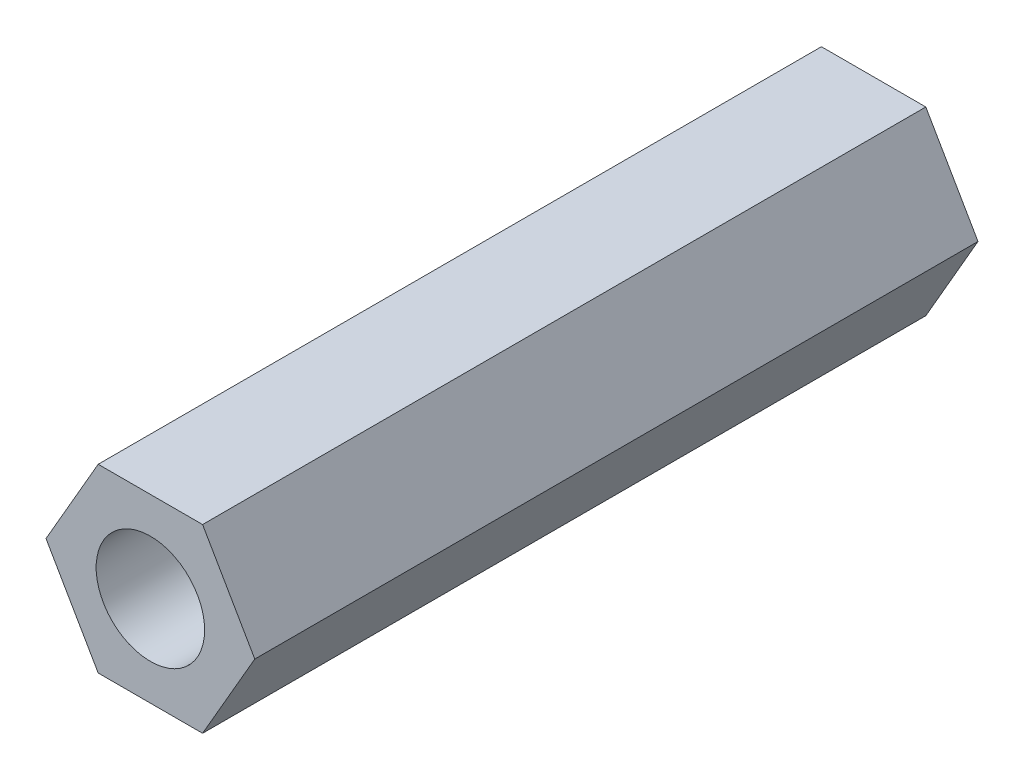
ISO-10303-21;
HEADER;
FILE_DESCRIPTION(('STEP AP214'),'2;1');
FILE_NAME('part.step','',(''),(''),'','','');
FILE_SCHEMA(('AUTOMOTIVE_DESIGN { 1 0 10303 214 1 1 1 1 }'));
ENDSEC;
DATA;
#1=APPLICATION_CONTEXT('core data for automotive mechanical design processes');
#2=APPLICATION_PROTOCOL_DEFINITION('international standard','automotive_design',2000,#1);
#3=PRODUCT_CONTEXT('',#1,'mechanical');
#4=PRODUCT('Part','Part','',(#3));
#5=PRODUCT_RELATED_PRODUCT_CATEGORY('part','',(#4));
#6=PRODUCT_DEFINITION_FORMATION('','',#4);
#7=PRODUCT_DEFINITION_CONTEXT('part definition',#1,'design');
#8=PRODUCT_DEFINITION('design','',#6,#7);
#9=PRODUCT_DEFINITION_SHAPE('','',#8);
#10=(LENGTH_UNIT() NAMED_UNIT(*) SI_UNIT(.MILLI.,.METRE.));
#11=(NAMED_UNIT(*) PLANE_ANGLE_UNIT() SI_UNIT($,.RADIAN.));
#12=(NAMED_UNIT(*) SI_UNIT($,.STERADIAN.) SOLID_ANGLE_UNIT());
#13=UNCERTAINTY_MEASURE_WITH_UNIT(LENGTH_MEASURE(1.E-05),#10,'distance_accuracy_value','');
#14=(GEOMETRIC_REPRESENTATION_CONTEXT(3) GLOBAL_UNCERTAINTY_ASSIGNED_CONTEXT((#13)) GLOBAL_UNIT_ASSIGNED_CONTEXT((#10,
#11,#12)) REPRESENTATION_CONTEXT('',''));
#15=CARTESIAN_POINT('',(0.,0.,0.));
#16=DIRECTION('',(0.,0.,1.));
#17=DIRECTION('',(1.,0.,0.));
#18=AXIS2_PLACEMENT_3D('',#15,#16,#17);
#19=CARTESIAN_POINT('',(0.,0.,20.));
#20=DIRECTION('',(0.,0.,1.));
#21=DIRECTION('',(1.,0.,0.));
#22=AXIS2_PLACEMENT_3D('',#19,#20,#21);
#23=PLANE('',#22);
#24=DIRECTION('',(1.,0.,0.));
#25=VECTOR('',#24,1.);
#26=CARTESIAN_POINT('',(-1.44337567297406,-2.5,20.));
#27=LINE('',#26,#25);
#28=CARTESIAN_POINT('',(-1.44337567297406,-2.5,20.));
#29=VERTEX_POINT('',#28);
#30=CARTESIAN_POINT('',(1.44337567297406,-2.5,20.));
#31=VERTEX_POINT('',#30);
#32=EDGE_CURVE('E130',#29,#31,#27,.T.);
#33=ORIENTED_EDGE('',*,*,#32,.T.);
#34=DIRECTION('',(0.5,0.866025403784439,0.));
#35=VECTOR('',#34,1.);
#36=CARTESIAN_POINT('',(1.44337567297406,-2.5,20.));
#37=LINE('',#36,#35);
#38=CARTESIAN_POINT('',(2.88675134594813,0.,20.));
#39=VERTEX_POINT('',#38);
#40=EDGE_CURVE('E88',#31,#39,#37,.T.);
#41=ORIENTED_EDGE('',*,*,#40,.T.);
#42=DIRECTION('',(-0.5,0.866025403784439,0.));
#43=VECTOR('',#42,1.);
#44=CARTESIAN_POINT('',(2.88675134594813,0.,20.));
#45=LINE('',#44,#43);
#46=CARTESIAN_POINT('',(1.44337567297406,2.5,20.));
#47=VERTEX_POINT('',#46);
#48=EDGE_CURVE('E101',#39,#47,#45,.T.);
#49=ORIENTED_EDGE('',*,*,#48,.T.);
#50=DIRECTION('',(-1.,0.,0.));
#51=VECTOR('',#50,1.);
#52=CARTESIAN_POINT('',(1.44337567297406,2.5,20.));
#53=LINE('',#52,#51);
#54=CARTESIAN_POINT('',(-1.44337567297406,2.5,20.));
#55=VERTEX_POINT('',#54);
#56=EDGE_CURVE('E95',#47,#55,#53,.T.);
#57=ORIENTED_EDGE('',*,*,#56,.T.);
#58=DIRECTION('',(-0.5,-0.866025403784438,0.));
#59=VECTOR('',#58,1.);
#60=CARTESIAN_POINT('',(-1.44337567297406,2.5,20.));
#61=LINE('',#60,#59);
#62=CARTESIAN_POINT('',(-2.88675134594813,0.,20.));
#63=VERTEX_POINT('',#62);
#64=EDGE_CURVE('E99',#55,#63,#61,.T.);
#65=ORIENTED_EDGE('',*,*,#64,.T.);
#66=DIRECTION('',(0.5,-0.866025403784439,0.));
#67=VECTOR('',#66,1.);
#68=CARTESIAN_POINT('',(-2.88675134594813,0.,20.));
#69=LINE('',#68,#67);
#70=EDGE_CURVE('E51',#63,#29,#69,.T.);
#71=ORIENTED_EDGE('',*,*,#70,.T.);
#72=EDGE_LOOP('',(#33,#41,#49,#57,#65,#71));
#73=FACE_BOUND('',#72,.T.);
#74=CARTESIAN_POINT('',(0.,0.,20.));
#75=DIRECTION('',(0.,0.,1.));
#76=DIRECTION('',(1.,0.,0.));
#77=AXIS2_PLACEMENT_3D('',#74,#75,#76);
#78=CIRCLE('',#77,1.5);
#79=CARTESIAN_POINT('',(1.5,0.,20.));
#80=VERTEX_POINT('',#79);
#81=EDGE_CURVE('E123',#80,#80,#78,.T.);
#82=ORIENTED_EDGE('',*,*,#81,.F.);
#83=EDGE_LOOP('',(#82));
#84=FACE_BOUND('',#83,.T.);
#85=ADVANCED_FACE('F34',(#73,#84),#23,.T.);
#86=CARTESIAN_POINT('',(0.,0.,0.));
#87=DIRECTION('',(0.,0.,1.));
#88=DIRECTION('',(1.,0.,0.));
#89=AXIS2_PLACEMENT_3D('',#86,#87,#88);
#90=PLANE('',#89);
#91=DIRECTION('',(1.,0.,0.));
#92=VECTOR('',#91,1.);
#93=CARTESIAN_POINT('',(-1.44337567297406,-2.5,0.));
#94=LINE('',#93,#92);
#95=CARTESIAN_POINT('',(-1.44337567297406,-2.5,0.));
#96=VERTEX_POINT('',#95);
#97=CARTESIAN_POINT('',(1.44337567297406,-2.5,0.));
#98=VERTEX_POINT('',#97);
#99=EDGE_CURVE('E119',#96,#98,#94,.T.);
#100=ORIENTED_EDGE('',*,*,#99,.F.);
#101=DIRECTION('',(0.5,-0.866025403784439,0.));
#102=VECTOR('',#101,1.);
#103=CARTESIAN_POINT('',(-2.88675134594813,0.,0.));
#104=LINE('',#103,#102);
#105=CARTESIAN_POINT('',(-2.88675134594813,0.,0.));
#106=VERTEX_POINT('',#105);
#107=EDGE_CURVE('E80',#106,#96,#104,.T.);
#108=ORIENTED_EDGE('',*,*,#107,.F.);
#109=DIRECTION('',(-0.5,-0.866025403784438,0.));
#110=VECTOR('',#109,1.);
#111=CARTESIAN_POINT('',(-1.44337567297406,2.5,0.));
#112=LINE('',#111,#110);
#113=CARTESIAN_POINT('',(-1.44337567297406,2.5,0.));
#114=VERTEX_POINT('',#113);
#115=EDGE_CURVE('E74',#114,#106,#112,.T.);
#116=ORIENTED_EDGE('',*,*,#115,.F.);
#117=DIRECTION('',(-1.,0.,0.));
#118=VECTOR('',#117,1.);
#119=CARTESIAN_POINT('',(1.44337567297406,2.5,0.));
#120=LINE('',#119,#118);
#121=CARTESIAN_POINT('',(1.44337567297406,2.5,0.));
#122=VERTEX_POINT('',#121);
#123=EDGE_CURVE('E109',#122,#114,#120,.T.);
#124=ORIENTED_EDGE('',*,*,#123,.F.);
#125=DIRECTION('',(-0.5,0.866025403784439,0.));
#126=VECTOR('',#125,1.);
#127=CARTESIAN_POINT('',(2.88675134594813,0.,0.));
#128=LINE('',#127,#126);
#129=CARTESIAN_POINT('',(2.88675134594813,0.,0.));
#130=VERTEX_POINT('',#129);
#131=EDGE_CURVE('E125',#130,#122,#128,.T.);
#132=ORIENTED_EDGE('',*,*,#131,.F.);
#133=DIRECTION('',(0.5,0.866025403784439,0.));
#134=VECTOR('',#133,1.);
#135=CARTESIAN_POINT('',(1.44337567297406,-2.5,0.));
#136=LINE('',#135,#134);
#137=EDGE_CURVE('E122',#98,#130,#136,.T.);
#138=ORIENTED_EDGE('',*,*,#137,.F.);
#139=EDGE_LOOP('',(#100,#108,#116,#124,#132,#138));
#140=FACE_BOUND('',#139,.T.);
#141=CARTESIAN_POINT('',(0.,0.,0.));
#142=DIRECTION('',(0.,0.,1.));
#143=DIRECTION('',(1.,0.,0.));
#144=AXIS2_PLACEMENT_3D('',#141,#142,#143);
#145=CIRCLE('',#144,1.5);
#146=CARTESIAN_POINT('',(1.5,0.,0.));
#147=VERTEX_POINT('',#146);
#148=EDGE_CURVE('E223',#147,#147,#145,.T.);
#149=ORIENTED_EDGE('',*,*,#148,.T.);
#150=EDGE_LOOP('',(#149));
#151=FACE_BOUND('',#150,.T.);
#152=ADVANCED_FACE('F139',(#140,#151),#90,.F.);
#153=CARTESIAN_POINT('',(-1.44337567297406,-2.5,20.));
#154=DIRECTION('',(0.,1.,0.));
#155=DIRECTION('',(-1.,0.,0.));
#156=AXIS2_PLACEMENT_3D('',#153,#154,#155);
#157=PLANE('',#156);
#158=ORIENTED_EDGE('',*,*,#99,.T.);
#159=DIRECTION('',(0.,0.,-1.));
#160=VECTOR('',#159,1.);
#161=CARTESIAN_POINT('',(1.44337567297406,-2.5,20.));
#162=LINE('',#161,#160);
#163=EDGE_CURVE('E11',#31,#98,#162,.T.);
#164=ORIENTED_EDGE('',*,*,#163,.F.);
#165=ORIENTED_EDGE('',*,*,#32,.F.);
#166=DIRECTION('',(0.,0.,-1.));
#167=VECTOR('',#166,1.);
#168=CARTESIAN_POINT('',(-1.44337567297406,-2.5,20.));
#169=LINE('',#168,#167);
#170=EDGE_CURVE('E115',#29,#96,#169,.T.);
#171=ORIENTED_EDGE('',*,*,#170,.T.);
#172=EDGE_LOOP('',(#158,#164,#165,#171));
#173=FACE_BOUND('',#172,.T.);
#174=ADVANCED_FACE('F36',(#173),#157,.F.);
#175=CARTESIAN_POINT('',(1.44337567297406,-2.5,20.));
#176=DIRECTION('',(-0.866025403784439,0.5,0.));
#177=DIRECTION('',(-0.5,-0.866025403784439,0.));
#178=AXIS2_PLACEMENT_3D('',#175,#176,#177);
#179=PLANE('',#178);
#180=ORIENTED_EDGE('',*,*,#137,.T.);
#181=DIRECTION('',(0.,0.,-1.));
#182=VECTOR('',#181,1.);
#183=CARTESIAN_POINT('',(2.88675134594813,0.,20.));
#184=LINE('',#183,#182);
#185=EDGE_CURVE('E43',#39,#130,#184,.T.);
#186=ORIENTED_EDGE('',*,*,#185,.F.);
#187=ORIENTED_EDGE('',*,*,#40,.F.);
#188=ORIENTED_EDGE('',*,*,#163,.T.);
#189=EDGE_LOOP('',(#180,#186,#187,#188));
#190=FACE_BOUND('',#189,.T.);
#191=ADVANCED_FACE('F164',(#190),#179,.F.);
#192=CARTESIAN_POINT('',(2.88675134594813,0.,20.));
#193=DIRECTION('',(-0.866025403784439,-0.5,0.));
#194=DIRECTION('',(0.5,-0.866025403784439,0.));
#195=AXIS2_PLACEMENT_3D('',#192,#193,#194);
#196=PLANE('',#195);
#197=ORIENTED_EDGE('',*,*,#131,.T.);
#198=DIRECTION('',(0.,0.,-1.));
#199=VECTOR('',#198,1.);
#200=CARTESIAN_POINT('',(1.44337567297406,2.5,20.));
#201=LINE('',#200,#199);
#202=EDGE_CURVE('E110',#47,#122,#201,.T.);
#203=ORIENTED_EDGE('',*,*,#202,.F.);
#204=ORIENTED_EDGE('',*,*,#48,.F.);
#205=ORIENTED_EDGE('',*,*,#185,.T.);
#206=EDGE_LOOP('',(#197,#203,#204,#205));
#207=FACE_BOUND('',#206,.T.);
#208=ADVANCED_FACE('F136',(#207),#196,.F.);
#209=CARTESIAN_POINT('',(1.44337567297406,2.5,20.));
#210=DIRECTION('',(0.,-1.,0.));
#211=DIRECTION('',(1.,0.,0.));
#212=AXIS2_PLACEMENT_3D('',#209,#210,#211);
#213=PLANE('',#212);
#214=ORIENTED_EDGE('',*,*,#123,.T.);
#215=DIRECTION('',(0.,0.,-1.));
#216=VECTOR('',#215,1.);
#217=CARTESIAN_POINT('',(-1.44337567297406,2.5,20.));
#218=LINE('',#217,#216);
#219=EDGE_CURVE('E106',#55,#114,#218,.T.);
#220=ORIENTED_EDGE('',*,*,#219,.F.);
#221=ORIENTED_EDGE('',*,*,#56,.F.);
#222=ORIENTED_EDGE('',*,*,#202,.T.);
#223=EDGE_LOOP('',(#214,#220,#221,#222));
#224=FACE_BOUND('',#223,.T.);
#225=ADVANCED_FACE('F107',(#224),#213,.F.);
#226=CARTESIAN_POINT('',(-1.44337567297406,2.5,20.));
#227=DIRECTION('',(0.866025403784439,-0.5,0.));
#228=DIRECTION('',(0.5,0.866025403784439,0.));
#229=AXIS2_PLACEMENT_3D('',#226,#227,#228);
#230=PLANE('',#229);
#231=ORIENTED_EDGE('',*,*,#115,.T.);
#232=DIRECTION('',(0.,0.,-1.));
#233=VECTOR('',#232,1.);
#234=CARTESIAN_POINT('',(-2.88675134594813,0.,20.));
#235=LINE('',#234,#233);
#236=EDGE_CURVE('E111',#63,#106,#235,.T.);
#237=ORIENTED_EDGE('',*,*,#236,.F.);
#238=ORIENTED_EDGE('',*,*,#64,.F.);
#239=ORIENTED_EDGE('',*,*,#219,.T.);
#240=EDGE_LOOP('',(#231,#237,#238,#239));
#241=FACE_BOUND('',#240,.T.);
#242=ADVANCED_FACE('F113',(#241),#230,.F.);
#243=CARTESIAN_POINT('',(-2.88675134594813,0.,20.));
#244=DIRECTION('',(0.866025403784439,0.5,0.));
#245=DIRECTION('',(-0.5,0.866025403784439,0.));
#246=AXIS2_PLACEMENT_3D('',#243,#244,#245);
#247=PLANE('',#246);
#248=ORIENTED_EDGE('',*,*,#107,.T.);
#249=ORIENTED_EDGE('',*,*,#170,.F.);
#250=ORIENTED_EDGE('',*,*,#70,.F.);
#251=ORIENTED_EDGE('',*,*,#236,.T.);
#252=EDGE_LOOP('',(#248,#249,#250,#251));
#253=FACE_BOUND('',#252,.T.);
#254=ADVANCED_FACE('F144',(#253),#247,.F.);
#255=CARTESIAN_POINT('',(0.,0.,20.));
#256=DIRECTION('',(0.,0.,-1.));
#257=DIRECTION('',(-1.,0.,0.));
#258=AXIS2_PLACEMENT_3D('',#255,#256,#257);
#259=CYLINDRICAL_SURFACE('',#258,1.5);
#260=ORIENTED_EDGE('',*,*,#81,.T.);
#261=EDGE_LOOP('',(#260));
#262=FACE_BOUND('',#261,.T.);
#263=ORIENTED_EDGE('',*,*,#148,.F.);
#264=EDGE_LOOP('',(#263));
#265=FACE_BOUND('',#264,.T.);
#266=ADVANCED_FACE('F146',(#262,#265),#259,.F.);
#267=CLOSED_SHELL('',(#85,#152,#174,#191,#208,#225,#242,#254,#266));
#268=MANIFOLD_SOLID_BREP('B2',#267);
#269=ADVANCED_BREP_SHAPE_REPRESENTATION('',(#18,#268),#14);
#270=SHAPE_DEFINITION_REPRESENTATION(#9,#269);
ENDSEC;
END-ISO-10303-21;
